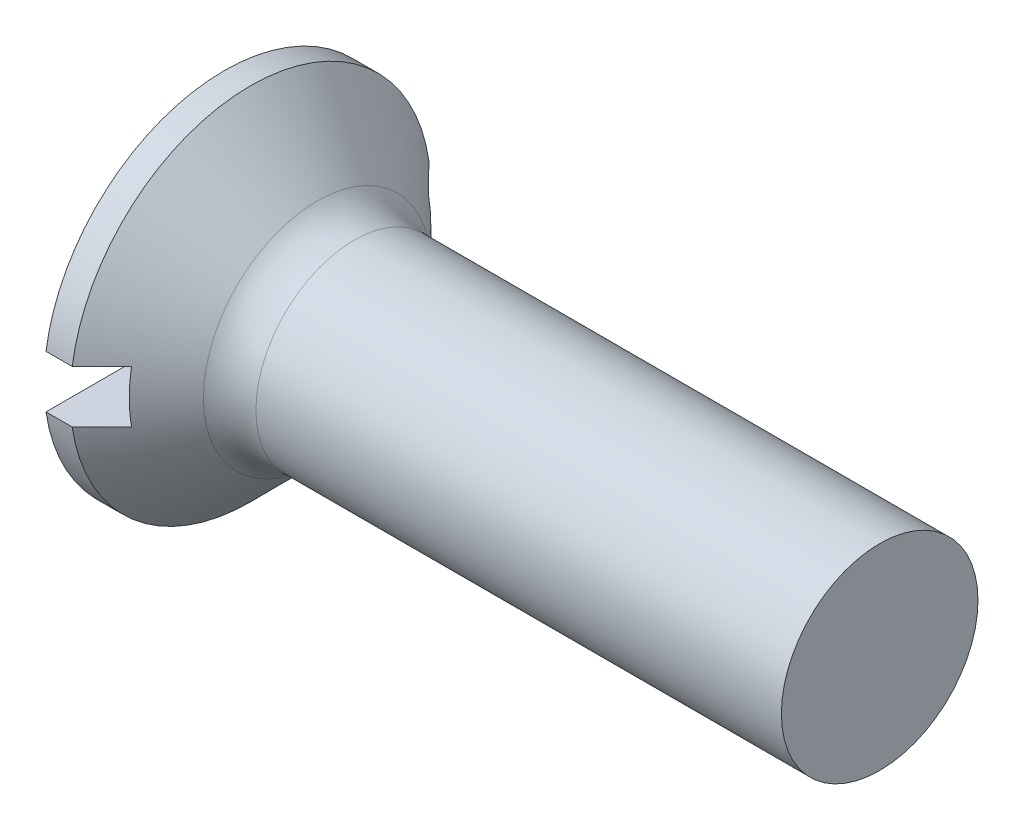
ISO-10303-21;
HEADER;
FILE_DESCRIPTION(('STEP AP214'),'2;1');
FILE_NAME('part.step','',(''),(''),'','','');
FILE_SCHEMA(('AUTOMOTIVE_DESIGN { 1 0 10303 214 1 1 1 1 }'));
ENDSEC;
DATA;
#1=APPLICATION_CONTEXT('core data for automotive mechanical design processes');
#2=APPLICATION_PROTOCOL_DEFINITION('international standard','automotive_design',2000,#1);
#3=PRODUCT_CONTEXT('',#1,'mechanical');
#4=PRODUCT('Part','Part','',(#3));
#5=PRODUCT_RELATED_PRODUCT_CATEGORY('part','',(#4));
#6=PRODUCT_DEFINITION_FORMATION('','',#4);
#7=PRODUCT_DEFINITION_CONTEXT('part definition',#1,'design');
#8=PRODUCT_DEFINITION('design','',#6,#7);
#9=PRODUCT_DEFINITION_SHAPE('','',#8);
#10=(LENGTH_UNIT() NAMED_UNIT(*) SI_UNIT(.MILLI.,.METRE.));
#11=(NAMED_UNIT(*) PLANE_ANGLE_UNIT() SI_UNIT($,.RADIAN.));
#12=(NAMED_UNIT(*) SI_UNIT($,.STERADIAN.) SOLID_ANGLE_UNIT());
#13=UNCERTAINTY_MEASURE_WITH_UNIT(LENGTH_MEASURE(1.E-05),#10,'distance_accuracy_value','');
#14=(GEOMETRIC_REPRESENTATION_CONTEXT(3) GLOBAL_UNCERTAINTY_ASSIGNED_CONTEXT((#13)) GLOBAL_UNIT_ASSIGNED_CONTEXT((#10,
#11,#12)) REPRESENTATION_CONTEXT('',''));
#15=CARTESIAN_POINT('',(0.,0.,0.));
#16=DIRECTION('',(0.,0.,1.));
#17=DIRECTION('',(1.,0.,0.));
#18=AXIS2_PLACEMENT_3D('',#15,#16,#17);
#19=CARTESIAN_POINT('',(-6.34999999999999,0.,0.));
#20=DIRECTION('',(-1.,0.,0.));
#21=DIRECTION('',(0.,0.,1.));
#22=AXIS2_PLACEMENT_3D('',#19,#20,#21);
#23=CYLINDRICAL_SURFACE('',#22,2.75);
#24=DIRECTION('',(-1.,0.,0.));
#25=VECTOR('',#24,1.);
#26=CARTESIAN_POINT('',(-6.34999999999999,0.4,-2.72075357208256));
#27=LINE('',#26,#25);
#28=CARTESIAN_POINT('',(0.,0.4,-2.72075357208256));
#29=VERTEX_POINT('',#28);
#30=CARTESIAN_POINT('',(0.400000000000005,0.4,-2.72075357208256));
#31=VERTEX_POINT('',#30);
#32=EDGE_CURVE('E65',#29,#31,#27,.F.);
#33=ORIENTED_EDGE('',*,*,#32,.F.);
#34=CARTESIAN_POINT('',(0.,0.,0.));
#35=DIRECTION('',(-1.,0.,0.));
#36=DIRECTION('',(0.,0.,1.));
#37=AXIS2_PLACEMENT_3D('',#34,#35,#36);
#38=CIRCLE('',#37,2.75);
#39=CARTESIAN_POINT('',(0.,0.4,2.72075357208256));
#40=VERTEX_POINT('',#39);
#41=EDGE_CURVE('E116',#40,#29,#38,.T.);
#42=ORIENTED_EDGE('',*,*,#41,.F.);
#43=DIRECTION('',(-1.,0.,0.));
#44=VECTOR('',#43,1.);
#45=CARTESIAN_POINT('',(-6.34999999999999,0.4,2.72075357208256));
#46=LINE('',#45,#44);
#47=CARTESIAN_POINT('',(0.400000000000005,0.4,2.72075357208256));
#48=VERTEX_POINT('',#47);
#49=EDGE_CURVE('E188',#48,#40,#46,.T.);
#50=ORIENTED_EDGE('',*,*,#49,.F.);
#51=CARTESIAN_POINT('',(0.400000000000005,0.,0.));
#52=DIRECTION('',(-1.,0.,0.));
#53=DIRECTION('',(0.,0.,1.));
#54=AXIS2_PLACEMENT_3D('',#51,#52,#53);
#55=CIRCLE('',#54,2.75);
#56=EDGE_CURVE('E128',#48,#31,#55,.T.);
#57=ORIENTED_EDGE('',*,*,#56,.T.);
#58=EDGE_LOOP('',(#33,#42,#50,#57));
#59=FACE_BOUND('',#58,.T.);
#60=ADVANCED_FACE('F41',(#59),#23,.T.);
#61=CARTESIAN_POINT('',(0.,0.,0.));
#62=DIRECTION('',(-1.,0.,0.));
#63=DIRECTION('',(0.,0.,1.));
#64=AXIS2_PLACEMENT_3D('',#61,#62,#63);
#65=PLANE('',#64);
#66=DIRECTION('',(0.,0.,-1.));
#67=VECTOR('',#66,1.);
#68=CARTESIAN_POINT('',(0.,0.4,0.));
#69=LINE('',#68,#67);
#70=EDGE_CURVE('E101',#40,#29,#69,.T.);
#71=ORIENTED_EDGE('',*,*,#70,.F.);
#72=ORIENTED_EDGE('',*,*,#41,.T.);
#73=EDGE_LOOP('',(#71,#72));
#74=FACE_BOUND('',#73,.T.);
#75=ADVANCED_FACE('F197',(#74),#65,.T.);
#76=CARTESIAN_POINT('',(10.,1.5,0.));
#77=DIRECTION('',(1.,0.,0.));
#78=DIRECTION('',(0.,0.,-1.));
#79=AXIS2_PLACEMENT_3D('',#76,#77,#78);
#80=PLANE('',#79);
#81=CARTESIAN_POINT('',(10.,0.,0.));
#82=DIRECTION('',(-1.,0.,0.));
#83=DIRECTION('',(0.,0.,1.));
#84=AXIS2_PLACEMENT_3D('',#81,#82,#83);
#85=CIRCLE('',#84,1.5);
#86=CARTESIAN_POINT('',(10.,0.,1.5));
#87=VERTEX_POINT('',#86);
#88=EDGE_CURVE('E129',#87,#87,#85,.T.);
#89=ORIENTED_EDGE('',*,*,#88,.F.);
#90=EDGE_LOOP('',(#89));
#91=FACE_BOUND('',#90,.T.);
#92=ADVANCED_FACE('F199',(#91),#80,.T.);
#93=CARTESIAN_POINT('',(-6.34999999999999,0.,0.));
#94=DIRECTION('',(-1.,0.,0.));
#95=DIRECTION('',(0.,0.,1.));
#96=AXIS2_PLACEMENT_3D('',#93,#94,#95);
#97=CYLINDRICAL_SURFACE('',#96,1.5);
#98=CARTESIAN_POINT('',(1.98137084989848,0.,0.));
#99=DIRECTION('',(-1.,0.,0.));
#100=DIRECTION('',(0.,0.,1.));
#101=AXIS2_PLACEMENT_3D('',#98,#99,#100);
#102=CIRCLE('',#101,1.5);
#103=CARTESIAN_POINT('',(1.98137084989848,0.,1.5));
#104=VERTEX_POINT('',#103);
#105=EDGE_CURVE('E102',#104,#104,#102,.F.);
#106=ORIENTED_EDGE('',*,*,#105,.T.);
#107=EDGE_LOOP('',(#106));
#108=FACE_BOUND('',#107,.T.);
#109=ORIENTED_EDGE('',*,*,#88,.T.);
#110=EDGE_LOOP('',(#109));
#111=FACE_BOUND('',#110,.T.);
#112=ADVANCED_FACE('F204',(#108,#111),#97,.T.);
#113=CARTESIAN_POINT('',(0.400000000000005,0.,0.));
#114=DIRECTION('',(-1.,0.,0.));
#115=DIRECTION('',(0.,0.,1.));
#116=AXIS2_PLACEMENT_3D('',#113,#114,#115);
#117=CONICAL_SURFACE('',#116,2.75,0.78539816339745);
#118=CARTESIAN_POINT('',(-2.91122703099808,0.399999999999999,-6.04801398157296));
#119=CARTESIAN_POINT('',(-2.70333669995712,0.399999999999999,-5.83966573752139));
#120=CARTESIAN_POINT('',(-2.49546630031166,0.399999999999999,-5.63129758737052));
#121=CARTESIAN_POINT('',(-2.07978706521848,0.399999999999999,-5.2144912620075));
#122=CARTESIAN_POINT('',(-1.87197823113852,0.399999999999999,-5.00605308543134));
#123=CARTESIAN_POINT('',(-1.45635477241037,0.399999999999999,-4.58898711382912));
#124=CARTESIAN_POINT('',(-1.2485401909839,0.399999999999999,-4.38035927572767));
#125=CARTESIAN_POINT('',(-0.833054486611349,0.399999999999999,-3.96296915720086));
#126=CARTESIAN_POINT('',(-0.625383360847279,0.399999999999999,-3.75420687958157));
#127=CARTESIAN_POINT('',(-0.208177797150706,0.399999999999999,-3.33435396336398));
#128=CARTESIAN_POINT('',(0.00135434759481753,0.4,-3.12326104596609));
#129=CARTESIAN_POINT('',(0.420030451513073,0.4,-2.70066518043499));
#130=CARTESIAN_POINT('',(0.629174386878202,0.4,-2.48916220868138));
#131=CARTESIAN_POINT('',(0.942224156138593,0.4,-2.1713129981671));
#132=CARTESIAN_POINT('',(1.04644766129475,0.4,-2.06527989301767));
#133=CARTESIAN_POINT('',(1.25455725538018,0.4,-1.85287805131423));
#134=CARTESIAN_POINT('',(1.35844333617521,0.4,-1.7465093067891));
#135=CARTESIAN_POINT('',(1.56564763937195,0.4,-1.53324094855307));
#136=CARTESIAN_POINT('',(1.66896592306241,0.4,-1.42634139460757));
#137=CARTESIAN_POINT('',(1.82313895681254,0.4,-1.26522565766366));
#138=CARTESIAN_POINT('',(1.87439491657569,0.4,-1.21139372905201));
#139=CARTESIAN_POINT('',(1.9765104755376,0.4,-1.10335558747567));
#140=CARTESIAN_POINT('',(2.02737008031461,0.4,-1.04914937979886));
#141=CARTESIAN_POINT('',(2.10536761914265,0.4,-0.965078768929768));
#142=CARTESIAN_POINT('',(2.13272119248435,0.4,-0.935414601324456));
#143=CARTESIAN_POINT('',(2.18719151166742,0.4,-0.875868286782248));
#144=CARTESIAN_POINT('',(2.21430825226833,0.4,-0.845986135048678));
#145=CARTESIAN_POINT('',(2.26822565449431,0.4,-0.785940027475329));
#146=CARTESIAN_POINT('',(2.29502633530682,0.4,-0.755776088943663));
#147=CARTESIAN_POINT('',(2.34818681038839,0.4,-0.695065970456104));
#148=CARTESIAN_POINT('',(2.37454662451584,0.4,-0.664519807826037));
#149=CARTESIAN_POINT('',(2.43976155242959,0.4,-0.587422608894616));
#150=CARTESIAN_POINT('',(2.4782379170761,0.4,-0.540543920717876));
#151=CARTESIAN_POINT('',(2.53401321051795,0.4,-0.468681597610833));
#152=CARTESIAN_POINT('',(2.55228877360357,0.4,-0.444459986191995));
#153=CARTESIAN_POINT('',(2.5878711479654,0.4,-0.39531915610884));
#154=CARTESIAN_POINT('',(2.60517823468484,0.4,-0.370400138848683));
#155=CARTESIAN_POINT('',(2.64157672655789,0.4,-0.314684261327312));
#156=CARTESIAN_POINT('',(2.66036306205222,0.4,-0.28368484243835));
#157=CARTESIAN_POINT('',(2.69440764635418,0.4,-0.219761693796643));
#158=CARTESIAN_POINT('',(2.70967206186428,0.4,-0.186841455937733));
#159=CARTESIAN_POINT('',(2.73016014153724,0.4,-0.129375221596078));
#160=CARTESIAN_POINT('',(2.73703138273339,0.4,-0.105439966049049));
#161=CARTESIAN_POINT('',(2.74668434716516,0.4,-0.0567945818244743));
#162=CARTESIAN_POINT('',(2.74948035548682,0.4,-0.0320874714607019));
#163=CARTESIAN_POINT('',(2.75038742305556,0.4,0.0175418217821301));
#164=CARTESIAN_POINT('',(2.74847509810649,0.4,0.0424644630823507));
#165=CARTESIAN_POINT('',(2.7403655224137,0.4,0.0916234589116821));
#166=CARTESIAN_POINT('',(2.73415677384007,0.4,0.115857789823385));
#167=CARTESIAN_POINT('',(2.71827371927204,0.4,0.164097461973524));
#168=CARTESIAN_POINT('',(2.70848082711735,0.4,0.188061916430982));
#169=CARTESIAN_POINT('',(2.68657810309996,0.4,0.234925488056131));
#170=CARTESIAN_POINT('',(2.67446406551726,0.4,0.257822576152259));
#171=CARTESIAN_POINT('',(2.64859519565537,0.4,0.302903050832693));
#172=CARTESIAN_POINT('',(2.63482775852877,0.4,0.325079071971884));
#173=CARTESIAN_POINT('',(2.60624001527761,0.4,0.368705812927868));
#174=CARTESIAN_POINT('',(2.59142061970022,0.4,0.390157136844758));
#175=CARTESIAN_POINT('',(2.54324495089253,0.4,0.457380684412003));
#176=CARTESIAN_POINT('',(2.5085311578627,0.4,0.502172551984684));
#177=CARTESIAN_POINT('',(2.4373574689067,0.4,0.590355519981424));
#178=CARTESIAN_POINT('',(2.40089644203552,0.4,0.633745681848963));
#179=CARTESIAN_POINT('',(2.32688330317303,0.4,0.719722652435567));
#180=CARTESIAN_POINT('',(2.28932931399318,0.4,0.762307843089061));
#181=CARTESIAN_POINT('',(2.21358878416378,0.4,0.846885546517387));
#182=CARTESIAN_POINT('',(2.17540243181154,0.4,0.888878229061745));
#183=CARTESIAN_POINT('',(2.06044068334854,0.4,1.01402227230979));
#184=CARTESIAN_POINT('',(1.98303698108055,0.4,1.09659540299884));
#185=CARTESIAN_POINT('',(1.82747335677727,0.4,1.26085212091516));
#186=CARTESIAN_POINT('',(1.74931433456999,0.4,1.34253656700302));
#187=CARTESIAN_POINT('',(1.59286602877705,0.4,1.50504082503211));
#188=CARTESIAN_POINT('',(1.51457909296922,0.4,1.58586289734369));
#189=CARTESIAN_POINT('',(1.35769196697884,0.4,1.74720261153539));
#190=CARTESIAN_POINT('',(1.27909177531288,0.4,1.82772025197037));
#191=CARTESIAN_POINT('',(1.04297819662847,0.4,2.06897290850551));
#192=CARTESIAN_POINT('',(0.885154889242076,0.4,2.22940447684664));
#193=CARTESIAN_POINT('',(0.569022750342737,0.4,2.54992542692343));
#194=CARTESIAN_POINT('',(0.410713737476895,0.4,2.71001462943086));
#195=CARTESIAN_POINT('',(0.093846751706257,0.4,3.02994348223417));
#196=CARTESIAN_POINT('',(-0.0647112188507847,0.4,3.18978313485537));
#197=CARTESIAN_POINT('',(-0.540591127347246,0.4,3.66904928426922));
#198=CARTESIAN_POINT('',(-0.858143098403681,0.400000000000001,3.98824727310349));
#199=CARTESIAN_POINT('',(-1.49349686932324,0.400000000000001,4.62632608508985));
#200=CARTESIAN_POINT('',(-1.81129863870678,0.400000000000001,4.94520693861199));
#201=CARTESIAN_POINT('',(-2.25950055023475,0.400000000000001,5.39470040618395));
#202=CARTESIAN_POINT('',(-2.38983276816512,0.400000000000001,5.5253807505132));
#203=CARTESIAN_POINT('',(-2.65051602794782,0.400000000000001,5.78671502436768));
#204=CARTESIAN_POINT('',(-2.78086706913672,0.400000000000001,5.91736895455466));
#205=CARTESIAN_POINT('',(-2.91122703099808,0.400000000000001,6.04801398157296));
#206=B_SPLINE_CURVE_WITH_KNOTS('',3,(#118,#119,#120,#121,#122,#123,#124,#125,#126,#127,#128,
#129,#130,#131,#132,#133,#134,#135,#136,#137,#138,#139,#140,#141,#142,#143,#144,#145,#146,#147,
#148,#149,#150,#151,#152,#153,#154,#155,#156,#157,#158,#159,#160,#161,#162,#163,#164,#165,#166,
#167,#168,#169,#170,#171,#172,#173,#174,#175,#176,#177,#178,#179,#180,#181,#182,#183,#184,#185,
#186,#187,#188,#189,#190,#191,#192,#193,#194,#195,#196,#197,#198,#199,#200,#201,#202,#203,#204,
#205),.UNSPECIFIED.,.F.,.F.,(4,2,2,2,2,2,2,2,2,2,2,2,2,2,2,2,2,2,2,2,2,2,2,2,2,2,2,2,2,2,2,2,2,
2,2,2,2,2,2,2,2,2,2,4),(0.,0.882975910860478,1.76597015363403,2.64937958225391,3.53277113384024,
4.42505762724969,5.31739714423807,5.76343472500757,6.20948297970986,6.65548210253547,
6.87847301535126,7.10146078413753,7.22251193727136,7.34356576218222,7.46461219989591,
7.58565317043343,7.7675312303056,7.85854400270903,7.94953075732351,8.05816632031485,
8.16661019949531,8.24105170239749,8.31523162951187,8.38978071779309,8.46453008531399,
8.54201686233401,8.61964538973785,8.69790858090398,8.77610483669631,8.94600506687254,
9.11601679556836,9.28634010861835,9.45661358569747,9.79613758747497,10.1352975424543,
10.4728599134667,10.8104238848897,11.4855651220709,12.1610000728679,12.8364286918874,
14.1871833908349,15.5377930820782,16.0914848296691,16.6451603543132),.UNSPECIFIED.);
#207=CARTESIAN_POINT('',(0.85,0.4,-2.26495033058123));
#208=VERTEX_POINT('',#207);
#209=EDGE_CURVE('E117',#31,#208,#206,.T.);
#210=ORIENTED_EDGE('',*,*,#209,.F.);
#211=ORIENTED_EDGE('',*,*,#56,.F.);
#212=CARTESIAN_POINT('',(0.85,0.4,2.26495033058123));
#213=VERTEX_POINT('',#212);
#214=EDGE_CURVE('E123',#213,#48,#206,.T.);
#215=ORIENTED_EDGE('',*,*,#214,.F.);
#216=CARTESIAN_POINT('',(0.85,0.,0.));
#217=DIRECTION('',(-1.,0.,0.));
#218=DIRECTION('',(0.,0.,1.));
#219=AXIS2_PLACEMENT_3D('',#216,#217,#218);
#220=CIRCLE('',#219,2.3);
#221=CARTESIAN_POINT('',(0.85,-0.400000000000001,2.26495033058123));
#222=VERTEX_POINT('',#221);
#223=EDGE_CURVE('E45',#213,#222,#220,.F.);
#224=ORIENTED_EDGE('',*,*,#223,.T.);
#225=CARTESIAN_POINT('',(-2.91122703099808,-0.400000000000001,6.04801398157296));
#226=CARTESIAN_POINT('',(-2.70333669995712,-0.400000000000001,5.83966573752139));
#227=CARTESIAN_POINT('',(-2.49546630031166,-0.400000000000001,5.63129758737052));
#228=CARTESIAN_POINT('',(-2.07978706521847,-0.400000000000001,5.2144912620075));
#229=CARTESIAN_POINT('',(-1.87197823113852,-0.400000000000001,5.00605308543134));
#230=CARTESIAN_POINT('',(-1.45635477241037,-0.400000000000001,4.58898711382912));
#231=CARTESIAN_POINT('',(-1.2485401909839,-0.400000000000001,4.38035927572767));
#232=CARTESIAN_POINT('',(-0.833054486611349,-0.400000000000001,3.96296915720086));
#233=CARTESIAN_POINT('',(-0.625383360847279,-0.400000000000001,3.75420687958157));
#234=CARTESIAN_POINT('',(-0.208177797150705,-0.400000000000001,3.33435396336398));
#235=CARTESIAN_POINT('',(0.00135434759481899,-0.400000000000001,3.12326104596609));
#236=CARTESIAN_POINT('',(0.420030451513074,-0.400000000000001,2.70066518043499));
#237=CARTESIAN_POINT('',(0.629174386878203,-0.400000000000001,2.48916220868137));
#238=CARTESIAN_POINT('',(0.942224156138594,-0.400000000000001,2.1713129981671));
#239=CARTESIAN_POINT('',(1.04644766129475,-0.400000000000001,2.06527989301766));
#240=CARTESIAN_POINT('',(1.25455725538018,-0.400000000000001,1.85287805131423));
#241=CARTESIAN_POINT('',(1.35844333617521,-0.400000000000001,1.7465093067891));
#242=CARTESIAN_POINT('',(1.56564763937195,-0.400000000000001,1.53324094855307));
#243=CARTESIAN_POINT('',(1.66896592306241,-0.400000000000001,1.42634139460756));
#244=CARTESIAN_POINT('',(1.82313895681255,-0.400000000000001,1.26522565766366));
#245=CARTESIAN_POINT('',(1.87439491657569,-0.400000000000001,1.211393729052));
#246=CARTESIAN_POINT('',(1.97651047553761,-0.400000000000001,1.10335558747567));
#247=CARTESIAN_POINT('',(2.02737008031461,-0.400000000000001,1.04914937979886));
#248=CARTESIAN_POINT('',(2.10536761914265,-0.400000000000001,0.965078768929766));
#249=CARTESIAN_POINT('',(2.13272119248435,-0.400000000000001,0.935414601324454));
#250=CARTESIAN_POINT('',(2.18719151166742,-0.400000000000001,0.875868286782245));
#251=CARTESIAN_POINT('',(2.21430825226833,-0.400000000000001,0.845986135048675));
#252=CARTESIAN_POINT('',(2.26822565449431,-0.400000000000001,0.785940027475326));
#253=CARTESIAN_POINT('',(2.29502633530682,-0.400000000000001,0.755776088943661));
#254=CARTESIAN_POINT('',(2.3481868103884,-0.400000000000001,0.695065970456102));
#255=CARTESIAN_POINT('',(2.37454662451584,-0.400000000000001,0.664519807826035));
#256=CARTESIAN_POINT('',(2.43976155242959,-0.400000000000001,0.587422608894614));
#257=CARTESIAN_POINT('',(2.4782379170761,-0.400000000000001,0.540543920717874));
#258=CARTESIAN_POINT('',(2.53401321051796,-0.400000000000001,0.468681597610831));
#259=CARTESIAN_POINT('',(2.55228877360357,-0.400000000000001,0.444459986191993));
#260=CARTESIAN_POINT('',(2.5878711479654,-0.400000000000001,0.395319156108837));
#261=CARTESIAN_POINT('',(2.60517823468485,-0.400000000000001,0.37040013884868));
#262=CARTESIAN_POINT('',(2.64157672655789,-0.400000000000001,0.314684261327309));
#263=CARTESIAN_POINT('',(2.66036306205222,-0.400000000000001,0.283684842438347));
#264=CARTESIAN_POINT('',(2.69440764635418,-0.400000000000001,0.219761693796641));
#265=CARTESIAN_POINT('',(2.70967206186428,-0.400000000000001,0.186841455937732));
#266=CARTESIAN_POINT('',(2.73016014153724,-0.400000000000001,0.129375221596077));
#267=CARTESIAN_POINT('',(2.73703138273339,-0.400000000000001,0.105439966049048));
#268=CARTESIAN_POINT('',(2.74668434716516,-0.400000000000001,0.056794581824473));
#269=CARTESIAN_POINT('',(2.74948035548682,-0.400000000000001,0.0320874714607006));
#270=CARTESIAN_POINT('',(2.75038742305555,-0.400000000000001,-0.0175418217821318));
#271=CARTESIAN_POINT('',(2.74847509810649,-0.400000000000001,-0.0424644630823528));
#272=CARTESIAN_POINT('',(2.7403655224137,-0.400000000000001,-0.0916234589116841));
#273=CARTESIAN_POINT('',(2.73415677384007,-0.400000000000001,-0.115857789823386));
#274=CARTESIAN_POINT('',(2.71827371927204,-0.400000000000001,-0.164097461973525));
#275=CARTESIAN_POINT('',(2.70848082711735,-0.400000000000001,-0.188061916430984));
#276=CARTESIAN_POINT('',(2.68657810309996,-0.400000000000001,-0.234925488056133));
#277=CARTESIAN_POINT('',(2.67446406551725,-0.400000000000001,-0.257822576152262));
#278=CARTESIAN_POINT('',(2.64859519565537,-0.400000000000001,-0.302903050832697));
#279=CARTESIAN_POINT('',(2.63482775852876,-0.400000000000001,-0.325079071971888));
#280=CARTESIAN_POINT('',(2.60624001527761,-0.400000000000001,-0.368705812927873));
#281=CARTESIAN_POINT('',(2.59142061970022,-0.400000000000001,-0.390157136844761));
#282=CARTESIAN_POINT('',(2.54324495089253,-0.400000000000001,-0.457380684412007));
#283=CARTESIAN_POINT('',(2.5085311578627,-0.400000000000001,-0.502172551984688));
#284=CARTESIAN_POINT('',(2.43735746890669,-0.400000000000001,-0.590355519981429));
#285=CARTESIAN_POINT('',(2.40089644203552,-0.400000000000001,-0.633745681848969));
#286=CARTESIAN_POINT('',(2.32688330317302,-0.400000000000001,-0.719722652435574));
#287=CARTESIAN_POINT('',(2.28932931399317,-0.400000000000001,-0.762307843089068));
#288=CARTESIAN_POINT('',(2.21358878416377,-0.400000000000001,-0.846885546517395));
#289=CARTESIAN_POINT('',(2.17540243181154,-0.400000000000001,-0.888878229061753));
#290=CARTESIAN_POINT('',(2.06044068334853,-0.400000000000001,-1.01402227230979));
#291=CARTESIAN_POINT('',(1.98303698108054,-0.400000000000001,-1.09659540299885));
#292=CARTESIAN_POINT('',(1.82747335677725,-0.400000000000001,-1.26085212091518));
#293=CARTESIAN_POINT('',(1.74931433456998,-0.400000000000001,-1.34253656700303));
#294=CARTESIAN_POINT('',(1.59286602877704,-0.400000000000001,-1.50504082503213));
#295=CARTESIAN_POINT('',(1.51457909296921,-0.400000000000001,-1.5858628973437));
#296=CARTESIAN_POINT('',(1.35769196697882,-0.400000000000001,-1.74720261153541));
#297=CARTESIAN_POINT('',(1.27909177531287,-0.400000000000001,-1.82772025197039));
#298=CARTESIAN_POINT('',(1.04297819662845,-0.400000000000001,-2.06897290850553));
#299=CARTESIAN_POINT('',(0.885154889242053,-0.400000000000001,-2.22940447684666));
#300=CARTESIAN_POINT('',(0.56902275034271,-0.400000000000001,-2.54992542692346));
#301=CARTESIAN_POINT('',(0.410713737476867,-0.400000000000001,-2.71001462943089));
#302=CARTESIAN_POINT('',(0.0938467517062253,-0.400000000000001,-3.0299434822342));
#303=CARTESIAN_POINT('',(-0.0647112188508182,-0.400000000000001,-3.1897831348554));
#304=CARTESIAN_POINT('',(-0.540591127347285,-0.400000000000001,-3.66904928426926));
#305=CARTESIAN_POINT('',(-0.858143098403724,-0.400000000000001,-3.98824727310353));
#306=CARTESIAN_POINT('',(-1.49349686932329,-0.400000000000001,-4.62632608508989));
#307=CARTESIAN_POINT('',(-1.81129863870683,-0.400000000000001,-4.94520693861204));
#308=CARTESIAN_POINT('',(-2.25950055023479,-0.400000000000001,-5.394700406184));
#309=CARTESIAN_POINT('',(-2.38983276816516,-0.400000000000001,-5.52538075051324));
#310=CARTESIAN_POINT('',(-2.65051602794784,-0.400000000000001,-5.7867150243677));
#311=CARTESIAN_POINT('',(-2.78086706913673,-0.400000000000001,-5.91736895455467));
#312=CARTESIAN_POINT('',(-2.91122703099808,-0.400000000000001,-6.04801398157296));
#313=B_SPLINE_CURVE_WITH_KNOTS('',3,(#225,#226,#227,#228,#229,#230,#231,#232,#233,#234,#235,
#236,#237,#238,#239,#240,#241,#242,#243,#244,#245,#246,#247,#248,#249,#250,#251,#252,#253,#254,
#255,#256,#257,#258,#259,#260,#261,#262,#263,#264,#265,#266,#267,#268,#269,#270,#271,#272,#273,
#274,#275,#276,#277,#278,#279,#280,#281,#282,#283,#284,#285,#286,#287,#288,#289,#290,#291,#292,
#293,#294,#295,#296,#297,#298,#299,#300,#301,#302,#303,#304,#305,#306,#307,#308,#309,#310,#311,
#312),.UNSPECIFIED.,.F.,.F.,(4,2,2,2,2,2,2,2,2,2,2,2,2,2,2,2,2,2,2,2,2,2,2,2,2,2,2,2,2,2,2,2,2,
2,2,2,2,2,2,2,2,2,2,4),(0.,0.882975910860477,1.76597015363403,2.6493795822539,3.53277113384024,
4.42505762724969,5.31739714423807,5.76343472500757,6.20948297970986,6.65548210253547,
6.87847301535126,7.10146078413754,7.22251193727136,7.34356576218222,7.46461219989591,
7.58565317043343,7.7675312303056,7.85854400270903,7.94953075732351,8.05816632031486,
8.16661019949531,8.24105170239749,8.31523162951187,8.38978071779309,8.46453008531399,
8.542016862334,8.61964538973785,8.69790858090398,8.77610483669631,8.94600506687254,
9.11601679556837,9.28634010861835,9.45661358569748,9.79613758747498,10.1352975424543,
10.4728599134667,10.8104238848897,11.4855651220709,12.1610000728679,12.8364286918874,
14.1871833908349,15.5377930820783,16.0914848296691,16.6451603543132),.UNSPECIFIED.);
#314=CARTESIAN_POINT('',(0.400000000000005,-0.400000000000001,2.72075357208256));
#315=VERTEX_POINT('',#314);
#316=EDGE_CURVE('E111',#315,#222,#313,.T.);
#317=ORIENTED_EDGE('',*,*,#316,.F.);
#318=CARTESIAN_POINT('',(0.400000000000005,-0.400000000000001,-2.72075357208256));
#319=VERTEX_POINT('',#318);
#320=EDGE_CURVE('E109',#319,#315,#55,.T.);
#321=ORIENTED_EDGE('',*,*,#320,.F.);
#322=CARTESIAN_POINT('',(0.85,-0.400000000000001,-2.26495033058123));
#323=VERTEX_POINT('',#322);
#324=EDGE_CURVE('E112',#323,#319,#313,.T.);
#325=ORIENTED_EDGE('',*,*,#324,.F.);
#326=EDGE_CURVE('E11',#323,#208,#220,.F.);
#327=ORIENTED_EDGE('',*,*,#326,.T.);
#328=EDGE_LOOP('',(#210,#211,#215,#224,#317,#321,#325,#327));
#329=FACE_BOUND('',#328,.T.);
#330=CARTESIAN_POINT('',(1.41568542494924,0.,0.));
#331=DIRECTION('',(-1.,0.,0.));
#332=DIRECTION('',(0.,0.,1.));
#333=AXIS2_PLACEMENT_3D('',#330,#331,#332);
#334=CIRCLE('',#333,1.73431457505076);
#335=CARTESIAN_POINT('',(1.41568542494924,0.,1.73431457505076));
#336=VERTEX_POINT('',#335);
#337=EDGE_CURVE('E133',#336,#336,#334,.T.);
#338=ORIENTED_EDGE('',*,*,#337,.T.);
#339=EDGE_LOOP('',(#338));
#340=FACE_BOUND('',#339,.T.);
#341=ADVANCED_FACE('F145',(#329,#340),#117,.T.);
#342=DIRECTION('',(-1.,0.,0.));
#343=VECTOR('',#342,1.);
#344=CARTESIAN_POINT('',(-6.34999999999999,-0.400000000000001,2.72075357208256));
#345=LINE('',#344,#343);
#346=CARTESIAN_POINT('',(0.,-0.400000000000001,2.72075357208256));
#347=VERTEX_POINT('',#346);
#348=EDGE_CURVE('E95',#347,#315,#345,.F.);
#349=ORIENTED_EDGE('',*,*,#348,.F.);
#350=CARTESIAN_POINT('',(0.,-0.400000000000001,-2.72075357208256));
#351=VERTEX_POINT('',#350);
#352=EDGE_CURVE('E107',#351,#347,#38,.T.);
#353=ORIENTED_EDGE('',*,*,#352,.F.);
#354=DIRECTION('',(-1.,0.,0.));
#355=VECTOR('',#354,1.);
#356=CARTESIAN_POINT('',(-6.34999999999999,-0.400000000000001,-2.72075357208256));
#357=LINE('',#356,#355);
#358=EDGE_CURVE('E57',#319,#351,#357,.T.);
#359=ORIENTED_EDGE('',*,*,#358,.F.);
#360=ORIENTED_EDGE('',*,*,#320,.T.);
#361=EDGE_LOOP('',(#349,#353,#359,#360));
#362=FACE_BOUND('',#361,.T.);
#363=ADVANCED_FACE('F106',(#362),#23,.T.);
#364=DIRECTION('',(0.,0.,1.));
#365=VECTOR('',#364,1.);
#366=CARTESIAN_POINT('',(0.,-0.400000000000001,0.));
#367=LINE('',#366,#365);
#368=EDGE_CURVE('E92',#351,#347,#367,.T.);
#369=ORIENTED_EDGE('',*,*,#368,.F.);
#370=ORIENTED_EDGE('',*,*,#352,.T.);
#371=EDGE_LOOP('',(#369,#370));
#372=FACE_BOUND('',#371,.T.);
#373=ADVANCED_FACE('F114',(#372),#65,.T.);
#374=CARTESIAN_POINT('',(1.98137084989848,0.,0.));
#375=DIRECTION('',(-1.,0.,0.));
#376=DIRECTION('',(0.,0.,1.));
#377=AXIS2_PLACEMENT_3D('',#374,#375,#376);
#378=TOROIDAL_SURFACE('',#377,2.3,0.8);
#379=ORIENTED_EDGE('',*,*,#105,.F.);
#380=EDGE_LOOP('',(#379));
#381=FACE_BOUND('',#380,.T.);
#382=ORIENTED_EDGE('',*,*,#337,.F.);
#383=EDGE_LOOP('',(#382));
#384=FACE_BOUND('',#383,.T.);
#385=ADVANCED_FACE('F43',(#381,#384),#378,.F.);
#386=CARTESIAN_POINT('',(0.85,0.4,2.75));
#387=DIRECTION('',(0.,1.,0.));
#388=DIRECTION('',(0.,0.,1.));
#389=AXIS2_PLACEMENT_3D('',#386,#387,#388);
#390=PLANE('',#389);
#391=ORIENTED_EDGE('',*,*,#209,.T.);
#392=DIRECTION('',(0.,0.,-1.));
#393=VECTOR('',#392,1.);
#394=CARTESIAN_POINT('',(0.85,0.4,2.75));
#395=LINE('',#394,#393);
#396=EDGE_CURVE('E153',#213,#208,#395,.T.);
#397=ORIENTED_EDGE('',*,*,#396,.F.);
#398=ORIENTED_EDGE('',*,*,#214,.T.);
#399=ORIENTED_EDGE('',*,*,#49,.T.);
#400=ORIENTED_EDGE('',*,*,#70,.T.);
#401=ORIENTED_EDGE('',*,*,#32,.T.);
#402=EDGE_LOOP('',(#391,#397,#398,#399,#400,#401));
#403=FACE_BOUND('',#402,.T.);
#404=ADVANCED_FACE('F156',(#403),#390,.F.);
#405=CARTESIAN_POINT('',(0.85,-0.400000000000001,-2.75));
#406=DIRECTION('',(0.,-1.,0.));
#407=DIRECTION('',(0.,0.,-1.));
#408=AXIS2_PLACEMENT_3D('',#405,#406,#407);
#409=PLANE('',#408);
#410=ORIENTED_EDGE('',*,*,#316,.T.);
#411=DIRECTION('',(0.,0.,1.));
#412=VECTOR('',#411,1.);
#413=CARTESIAN_POINT('',(0.85,-0.400000000000001,-2.75));
#414=LINE('',#413,#412);
#415=EDGE_CURVE('E155',#323,#222,#414,.T.);
#416=ORIENTED_EDGE('',*,*,#415,.F.);
#417=ORIENTED_EDGE('',*,*,#324,.T.);
#418=ORIENTED_EDGE('',*,*,#358,.T.);
#419=ORIENTED_EDGE('',*,*,#368,.T.);
#420=ORIENTED_EDGE('',*,*,#348,.T.);
#421=EDGE_LOOP('',(#410,#416,#417,#418,#419,#420));
#422=FACE_BOUND('',#421,.T.);
#423=ADVANCED_FACE('F94',(#422),#409,.F.);
#424=CARTESIAN_POINT('',(0.85,0.4,-2.75));
#425=DIRECTION('',(-1.,0.,0.));
#426=DIRECTION('',(0.,0.,1.));
#427=AXIS2_PLACEMENT_3D('',#424,#425,#426);
#428=PLANE('',#427);
#429=ORIENTED_EDGE('',*,*,#415,.T.);
#430=ORIENTED_EDGE('',*,*,#223,.F.);
#431=ORIENTED_EDGE('',*,*,#396,.T.);
#432=ORIENTED_EDGE('',*,*,#326,.F.);
#433=EDGE_LOOP('',(#429,#430,#431,#432));
#434=FACE_BOUND('',#433,.T.);
#435=ADVANCED_FACE('F152',(#434),#428,.T.);
#436=CLOSED_SHELL('',(#60,#75,#92,#112,#341,#363,#373,#385,#404,#423,#435));
#437=MANIFOLD_SOLID_BREP('B2',#436);
#438=ADVANCED_BREP_SHAPE_REPRESENTATION('',(#18,#437),#14);
#439=SHAPE_DEFINITION_REPRESENTATION(#9,#438);
ENDSEC;
END-ISO-10303-21;
